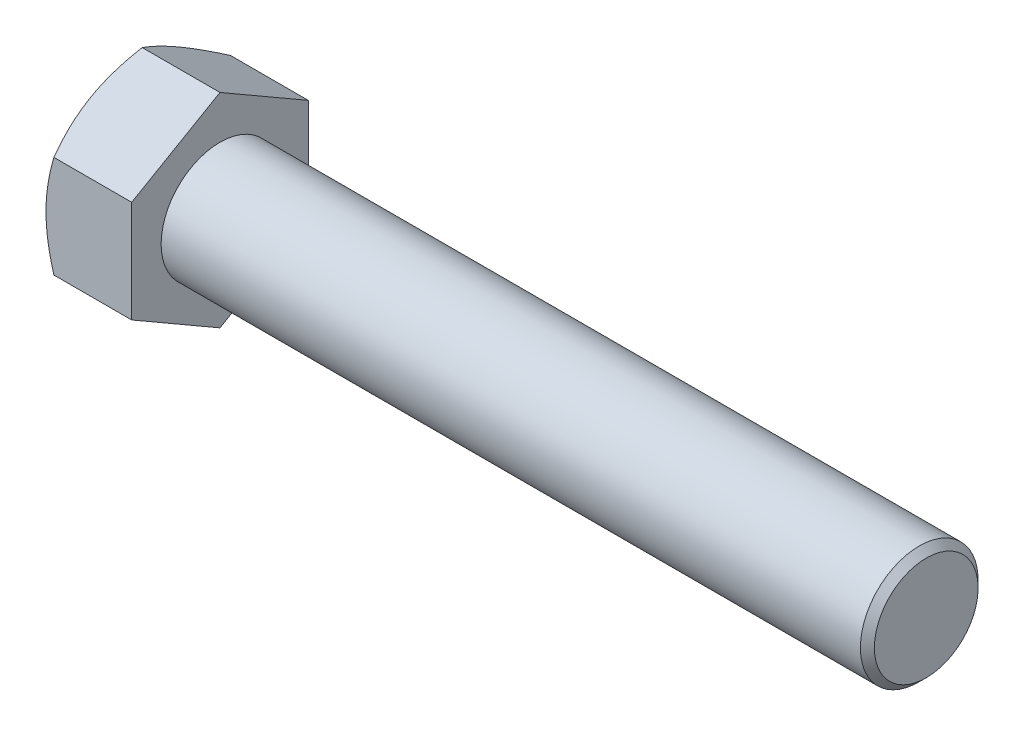
ISO-10303-21;
HEADER;
FILE_DESCRIPTION(('STEP AP214'),'2;1');
FILE_NAME('part.step','',(''),(''),'','','');
FILE_SCHEMA(('AUTOMOTIVE_DESIGN { 1 0 10303 214 1 1 1 1 }'));
ENDSEC;
DATA;
#1=APPLICATION_CONTEXT('core data for automotive mechanical design processes');
#2=APPLICATION_PROTOCOL_DEFINITION('international standard','automotive_design',2000,#1);
#3=PRODUCT_CONTEXT('',#1,'mechanical');
#4=PRODUCT('Part','Part','',(#3));
#5=PRODUCT_RELATED_PRODUCT_CATEGORY('part','',(#4));
#6=PRODUCT_DEFINITION_FORMATION('','',#4);
#7=PRODUCT_DEFINITION_CONTEXT('part definition',#1,'design');
#8=PRODUCT_DEFINITION('design','',#6,#7);
#9=PRODUCT_DEFINITION_SHAPE('','',#8);
#10=(LENGTH_UNIT() NAMED_UNIT(*) SI_UNIT(.MILLI.,.METRE.));
#11=(NAMED_UNIT(*) PLANE_ANGLE_UNIT() SI_UNIT($,.RADIAN.));
#12=(NAMED_UNIT(*) SI_UNIT($,.STERADIAN.) SOLID_ANGLE_UNIT());
#13=UNCERTAINTY_MEASURE_WITH_UNIT(LENGTH_MEASURE(1.E-05),#10,'distance_accuracy_value','');
#14=(GEOMETRIC_REPRESENTATION_CONTEXT(3) GLOBAL_UNCERTAINTY_ASSIGNED_CONTEXT((#13)) GLOBAL_UNIT_ASSIGNED_CONTEXT((#10,
#11,#12)) REPRESENTATION_CONTEXT('',''));
#15=CARTESIAN_POINT('',(0.,0.,0.));
#16=DIRECTION('',(0.,0.,1.));
#17=DIRECTION('',(1.,0.,0.));
#18=AXIS2_PLACEMENT_3D('',#15,#16,#17);
#19=CARTESIAN_POINT('',(9.2456,5.49926131403118,-9.525));
#20=DIRECTION('',(0.,-0.866025403784438,0.500000000000001));
#21=DIRECTION('',(0.,-0.500000000000001,-0.866025403784438));
#22=AXIS2_PLACEMENT_3D('',#19,#20,#21);
#23=PLANE('',#22);
#24=CARTESIAN_POINT('',(0.85080535368534,10.9986380981162,0.0002));
#25=CARTESIAN_POINT('',(0.781023201247654,10.8777523132173,-0.209180321357815));
#26=CARTESIAN_POINT('',(0.714408233957876,10.7564158029679,-0.419341321922845));
#27=CARTESIAN_POINT('',(0.588391469790026,10.5127697532954,-0.841348659019077));
#28=CARTESIAN_POINT('',(0.528992045309777,10.3904599078574,-1.05319552558364));
#29=CARTESIAN_POINT('',(0.362766604707597,10.0215595864394,-1.69214962520808));
#30=CARTESIAN_POINT('',(0.268218329918826,9.77351282584137,-2.12177921721668));
#31=CARTESIAN_POINT('',(0.157351628845433,9.40232220358295,-2.76470023426138));
#32=CARTESIAN_POINT('',(0.125769866148956,9.28028730086357,-2.97607088606807));
#33=CARTESIAN_POINT('',(0.0728092531292063,9.03565248016184,-3.39979082482397));
#34=CARTESIAN_POINT('',(0.0514305991810341,8.91305255135051,-3.61214013052952));
#35=CARTESIAN_POINT('',(0.0194239766724832,8.66764818787802,-4.03719295646296));
#36=CARTESIAN_POINT('',(0.00878323258550251,8.54484417077186,-4.24989575346439));
#37=CARTESIAN_POINT('',(-0.00152146504907483,8.29912270270346,-4.67549782066928));
#38=CARTESIAN_POINT('',(-0.0011857577353514,8.17620525536319,-4.88839708459929));
#39=CARTESIAN_POINT('',(0.00969884023177861,7.94640807689151,-5.28641747314822));
#40=CARTESIAN_POINT('',(0.0189199445075671,7.83951212670956,-5.4715666899867));
#41=CARTESIAN_POINT('',(0.0454848010115662,7.62597023317658,-5.84143209913029));
#42=CARTESIAN_POINT('',(0.0628291278252554,7.5193243080471,-6.02614825987472));
#43=CARTESIAN_POINT('',(0.126636878025749,7.19979976097279,-6.57958100967286));
#44=CARTESIAN_POINT('',(0.184867121471559,6.98748672019119,-6.94731798341605));
#45=CARTESIAN_POINT('',(0.330443291970775,6.56060850831896,-7.68669273502289));
#46=CARTESIAN_POINT('',(0.41840629634645,6.3460978161353,-8.05823615265175));
#47=CARTESIAN_POINT('',(0.618045797355988,5.92027529884848,-8.79578238759941));
#48=CARTESIAN_POINT('',(0.729675405460148,5.70895802095901,-9.16179464942111));
#49=CARTESIAN_POINT('',(0.850805353685332,5.49914584397734,-9.5252));
#50=B_SPLINE_CURVE_WITH_KNOTS('',3,(#24,#25,#26,#27,#28,#29,#30,#31,#32,#33,#34,#35,#36,#37,#38,
#39,#40,#41,#42,#43,#44,#45,#46,#47,#48,#49),.UNSPECIFIED.,.F.,.F.,(4,2,2,2,2,2,2,2,2,2,2,2,4),
(0.,0.754861746958004,1.50997101692212,3.02340406075151,3.76154608748042,4.49970232035707,
5.23697928598072,5.97423347202913,6.61604550518408,7.25790294292824,8.54252993638602,
9.85564695316764,11.1661863217647),.UNSPECIFIED.);
#51=CARTESIAN_POINT('',(0.850738685968815,10.9985226280624,0.));
#52=VERTEX_POINT('',#51);
#53=CARTESIAN_POINT('',(0.,8.24889197104677,-4.76250000000001));
#54=VERTEX_POINT('',#53);
#55=EDGE_CURVE('E51',#52,#54,#50,.T.);
#56=ORIENTED_EDGE('',*,*,#55,.F.);
#57=DIRECTION('',(-1.,0.,0.));
#58=VECTOR('',#57,1.);
#59=CARTESIAN_POINT('',(9.2456,10.9985226280624,0.));
#60=LINE('',#59,#58);
#61=CARTESIAN_POINT('',(9.2456,10.9985226280624,0.));
#62=VERTEX_POINT('',#61);
#63=EDGE_CURVE('E147',#62,#52,#60,.T.);
#64=ORIENTED_EDGE('',*,*,#63,.F.);
#65=DIRECTION('',(0.,0.500000000000001,0.866025403784438));
#66=VECTOR('',#65,1.);
#67=CARTESIAN_POINT('',(9.2456,5.49926131403118,-9.525));
#68=LINE('',#67,#66);
#69=CARTESIAN_POINT('',(9.2456,5.49926131403118,-9.525));
#70=VERTEX_POINT('',#69);
#71=EDGE_CURVE('E232',#70,#62,#68,.T.);
#72=ORIENTED_EDGE('',*,*,#71,.F.);
#73=DIRECTION('',(-1.,0.,0.));
#74=VECTOR('',#73,1.);
#75=CARTESIAN_POINT('',(9.2456,5.49926131403118,-9.525));
#76=LINE('',#75,#74);
#77=CARTESIAN_POINT('',(0.850738685968809,5.49926131403118,-9.525));
#78=VERTEX_POINT('',#77);
#79=EDGE_CURVE('E135',#70,#78,#76,.T.);
#80=ORIENTED_EDGE('',*,*,#79,.T.);
#81=EDGE_CURVE('E129',#54,#78,#50,.T.);
#82=ORIENTED_EDGE('',*,*,#81,.F.);
#83=EDGE_LOOP('',(#56,#64,#72,#80,#82));
#84=FACE_BOUND('',#83,.T.);
#85=ADVANCED_FACE('F35',(#84),#23,.F.);
#86=CARTESIAN_POINT('',(9.2456,10.9985226280624,0.));
#87=DIRECTION('',(0.,-0.866025403784438,-0.500000000000001));
#88=DIRECTION('',(0.,0.500000000000001,-0.866025403784438));
#89=AXIS2_PLACEMENT_3D('',#86,#87,#88);
#90=PLANE('',#89);
#91=CARTESIAN_POINT('',(0.850805353685333,5.49914584397734,9.5252));
#92=CARTESIAN_POINT('',(0.781023201247648,5.62003162887629,9.31581967864219));
#93=CARTESIAN_POINT('',(0.71440823395787,5.74136813912567,9.10565867807716));
#94=CARTESIAN_POINT('',(0.588391469790021,5.98501418879817,8.68365134098092));
#95=CARTESIAN_POINT('',(0.528992045309771,6.1073240342362,8.47180447441637));
#96=CARTESIAN_POINT('',(0.362766604707592,6.47622435565419,7.83285037479193));
#97=CARTESIAN_POINT('',(0.268218329918823,6.72427111625219,7.40322078278332));
#98=CARTESIAN_POINT('',(0.157351628845431,7.09546173851061,6.76029976573862));
#99=CARTESIAN_POINT('',(0.125769866148954,7.21749664122999,6.54892911393193));
#100=CARTESIAN_POINT('',(0.0728092531292047,7.46213146193172,6.12520917517604));
#101=CARTESIAN_POINT('',(0.0514305991810333,7.58473139074305,5.91285986947049));
#102=CARTESIAN_POINT('',(0.0194239766724829,7.83013575421554,5.48780704353704));
#103=CARTESIAN_POINT('',(0.00878323258550203,7.9529397713217,5.27510424653562));
#104=CARTESIAN_POINT('',(-0.00152146504907482,8.1986612393901,4.84950217933072));
#105=CARTESIAN_POINT('',(-0.00118575773535079,8.32157868673037,4.63660291540071));
#106=CARTESIAN_POINT('',(0.00969884023177998,8.55137586520205,4.23858252685179));
#107=CARTESIAN_POINT('',(0.0189199445075688,8.658271815384,4.05343331001331));
#108=CARTESIAN_POINT('',(0.0454848010115681,8.87181370891698,3.68356790086971));
#109=CARTESIAN_POINT('',(0.0628291278252573,8.97845963404645,3.49885174012528));
#110=CARTESIAN_POINT('',(0.126636878025752,9.29798418112077,2.94541899032714));
#111=CARTESIAN_POINT('',(0.184867121471562,9.51029722190237,2.57768201658395));
#112=CARTESIAN_POINT('',(0.330443291970781,9.9371754337746,1.83830726497711));
#113=CARTESIAN_POINT('',(0.418406296346457,10.1516861259583,1.46676384734825));
#114=CARTESIAN_POINT('',(0.618045797355995,10.5775086432451,0.729217612400586));
#115=CARTESIAN_POINT('',(0.729675405460156,10.7888259211345,0.363205350578886));
#116=CARTESIAN_POINT('',(0.85080535368534,10.9986380981162,-0.000199999999999453));
#117=B_SPLINE_CURVE_WITH_KNOTS('',3,(#91,#92,#93,#94,#95,#96,#97,#98,#99,#100,#101,#102,#103,
#104,#105,#106,#107,#108,#109,#110,#111,#112,#113,#114,#115,#116),.UNSPECIFIED.,.F.,.F.,(4,2,2,
2,2,2,2,2,2,2,2,2,4),(0.,0.754861746958003,1.50997101692211,3.02340406075151,3.76154608748042,
4.49970232035706,5.23697928598072,5.97423347202913,6.61604550518408,7.25790294292824,
8.54252993638602,9.85564695316764,11.1661863217647),.UNSPECIFIED.);
#118=CARTESIAN_POINT('',(0.850738685968809,5.49926131403118,9.525));
#119=VERTEX_POINT('',#118);
#120=CARTESIAN_POINT('',(0.,8.24889197104677,4.76250000000001));
#121=VERTEX_POINT('',#120);
#122=EDGE_CURVE('E58',#119,#121,#117,.T.);
#123=ORIENTED_EDGE('',*,*,#122,.F.);
#124=DIRECTION('',(-1.,0.,0.));
#125=VECTOR('',#124,1.);
#126=CARTESIAN_POINT('',(9.2456,5.49926131403118,9.525));
#127=LINE('',#126,#125);
#128=CARTESIAN_POINT('',(9.2456,5.49926131403118,9.525));
#129=VERTEX_POINT('',#128);
#130=EDGE_CURVE('E145',#129,#119,#127,.T.);
#131=ORIENTED_EDGE('',*,*,#130,.F.);
#132=DIRECTION('',(0.,-0.500000000000001,0.866025403784438));
#133=VECTOR('',#132,1.);
#134=CARTESIAN_POINT('',(9.2456,10.9985226280624,0.));
#135=LINE('',#134,#133);
#136=EDGE_CURVE('E230',#62,#129,#135,.T.);
#137=ORIENTED_EDGE('',*,*,#136,.F.);
#138=ORIENTED_EDGE('',*,*,#63,.T.);
#139=EDGE_CURVE('E162',#121,#52,#117,.T.);
#140=ORIENTED_EDGE('',*,*,#139,.F.);
#141=EDGE_LOOP('',(#123,#131,#137,#138,#140));
#142=FACE_BOUND('',#141,.T.);
#143=ADVANCED_FACE('F168',(#142),#90,.F.);
#144=CARTESIAN_POINT('',(9.2456,5.49926131403118,9.525));
#145=DIRECTION('',(0.,0.,-1.));
#146=DIRECTION('',(-1.,0.,0.));
#147=AXIS2_PLACEMENT_3D('',#144,#145,#146);
#148=PLANE('',#147);
#149=CARTESIAN_POINT('',(4.652978620201,-14.7810115366526,9.525));
#150=CARTESIAN_POINT('',(4.55200114697973,-14.5729402848548,9.525));
#151=CARTESIAN_POINT('',(4.45152657852499,-14.3646250845143,9.525));
#152=CARTESIAN_POINT('',(4.25169715270383,-13.9474558848886,9.525));
#153=CARTESIAN_POINT('',(4.15234230655457,-13.7386018802315,9.525));
#154=CARTESIAN_POINT('',(3.85610205085235,-13.1110997604408,9.525));
#155=CARTESIAN_POINT('',(3.66107082946321,-12.6915729928092,9.525));
#156=CARTESIAN_POINT('',(3.27608312845874,-11.8474364819289,9.525));
#157=CARTESIAN_POINT('',(3.0861599652033,-11.4228115070931,9.525));
#158=CARTESIAN_POINT('',(2.71407238167632,-10.5701875182868,9.525));
#159=CARTESIAN_POINT('',(2.53190759510787,-10.1421886647409,9.525));
#160=CARTESIAN_POINT('',(2.17173180421228,-9.26840827793762,9.525));
#161=CARTESIAN_POINT('',(1.99403865760542,-8.82249500065039,9.525));
#162=CARTESIAN_POINT('',(1.65207801715252,-7.92545654404829,9.525));
#163=CARTESIAN_POINT('',(1.48781202814776,-7.47433078699668,9.525));
#164=CARTESIAN_POINT('',(1.17701101312695,-6.56698486643262,9.525));
#165=CARTESIAN_POINT('',(1.03044020737989,-6.11077709183234,9.525));
#166=CARTESIAN_POINT('',(0.759723980462397,-5.19183461770946,9.525));
#167=CARTESIAN_POINT('',(0.635571508908768,-4.72910201971935,9.525));
#168=CARTESIAN_POINT('',(0.416296039044828,-3.79927533749825,9.525));
#169=CARTESIAN_POINT('',(0.321019170056998,-3.33221854628569,9.525));
#170=CARTESIAN_POINT('',(0.203895327456021,-2.62737339603034,9.525));
#171=CARTESIAN_POINT('',(0.169151073901595,-2.39169815065083,9.525));
#172=CARTESIAN_POINT('',(0.10894089832577,-1.91917305353182,9.525));
#173=CARTESIAN_POINT('',(0.0834740799106724,-1.68232331751526,9.525));
#174=CARTESIAN_POINT('',(0.0426462139382919,-1.21086692666172,9.525));
#175=CARTESIAN_POINT('',(0.0271575476697097,-0.976271367216093,9.525));
#176=CARTESIAN_POINT('',(0.00611497588533555,-0.506635508477946,9.525));
#177=CARTESIAN_POINT('',(0.000560905150696466,-0.271595216646692,9.525));
#178=CARTESIAN_POINT('',(-0.00047996713179039,0.198511625361335,9.525));
#179=CARTESIAN_POINT('',(0.00403333600034654,0.433578175785729,9.525));
#180=CARTESIAN_POINT('',(0.0230169602197968,0.903311845567771,9.525));
#181=CARTESIAN_POINT('',(0.0374877771856492,1.13797894444949,9.525));
#182=CARTESIAN_POINT('',(0.083892600232871,1.70156520102241,9.525));
#183=CARTESIAN_POINT('',(0.12052919649143,2.03010533257162,9.525));
#184=CARTESIAN_POINT('',(0.211324091565228,2.68473880457707,9.525));
#185=CARTESIAN_POINT('',(0.265484757377357,3.01083180840529,9.525));
#186=CARTESIAN_POINT('',(0.451380100896851,3.98506326209962,9.525));
#187=CARTESIAN_POINT('',(0.606495020219101,4.62879899939554,9.525));
#188=CARTESIAN_POINT('',(0.875429330956874,5.59158230732314,9.525));
#189=CARTESIAN_POINT('',(0.972405254059028,5.9156214246882,9.525));
#190=CARTESIAN_POINT('',(1.1764087393435,6.56055109397584,9.525));
#191=CARTESIAN_POINT('',(1.28343637307408,6.88144162346875,9.525));
#192=CARTESIAN_POINT('',(1.50582732440541,7.52017825999875,9.525));
#193=CARTESIAN_POINT('',(1.62118794476214,7.83802531476308,9.525));
#194=CARTESIAN_POINT('',(1.85888923263679,8.4710843172018,9.525));
#195=CARTESIAN_POINT('',(1.98122977973553,8.78629631022934,9.525));
#196=CARTESIAN_POINT('',(2.30063477459309,9.58716274310341,9.525));
#197=CARTESIAN_POINT('',(2.50178184900059,10.0711868007297,9.525));
#198=CARTESIAN_POINT('',(2.91473175900992,11.0346830906918,9.525));
#199=CARTESIAN_POINT('',(3.12653548923491,11.514154936841,9.525));
#200=CARTESIAN_POINT('',(3.55844219486127,12.4695072075479,9.525));
#201=CARTESIAN_POINT('',(3.77854763045353,12.9453865165195,9.525));
#202=CARTESIAN_POINT('',(4.22520690131798,13.8940827737157,9.525));
#203=CARTESIAN_POINT('',(4.45176054207862,14.3668998137873,9.525));
#204=CARTESIAN_POINT('',(4.91030379081787,15.31066754278,9.525));
#205=CARTESIAN_POINT('',(5.14230026383005,15.7816148898186,9.525));
#206=CARTESIAN_POINT('',(5.6104341919885,16.7214473380242,9.525));
#207=CARTESIAN_POINT('',(5.84657167244607,17.190332426564,9.525));
#208=CARTESIAN_POINT('',(6.32217781208353,18.1263065899709,9.525));
#209=CARTESIAN_POINT('',(6.56164589066583,18.5933959601918,9.525));
#210=CARTESIAN_POINT('',(7.0433639405291,19.5261387749102,9.525));
#211=CARTESIAN_POINT('',(7.28561392258588,19.9917922138368,9.525));
#212=CARTESIAN_POINT('',(7.96929589667506,21.2980525732429,9.525));
#213=CARTESIAN_POINT('',(8.41334550528854,22.137289288128,9.525));
#214=CARTESIAN_POINT('',(9.30698696570736,23.81285124024,9.525));
#215=CARTESIAN_POINT('',(9.7565790806491,24.6491763367986,9.525));
#216=CARTESIAN_POINT('',(10.6586387715906,26.3171534675354,9.525));
#217=CARTESIAN_POINT('',(11.1110942984919,27.1488120222569,9.525));
#218=CARTESIAN_POINT('',(11.7921739160347,28.394953533384,9.525));
#219=CARTESIAN_POINT('',(12.0195924712891,28.8100962856009,9.525));
#220=CARTESIAN_POINT('',(12.4751463020887,29.6399876727052,9.525));
#221=CARTESIAN_POINT('',(12.7032815766791,30.0547363081167,9.525));
#222=CARTESIAN_POINT('',(12.9317320980145,30.4693112732241,9.525));
#223=B_SPLINE_CURVE_WITH_KNOTS('',3,(#149,#150,#151,#152,#153,#154,#155,#156,#157,#158,#159,
#160,#161,#162,#163,#164,#165,#166,#167,#168,#169,#170,#171,#172,#173,#174,#175,#176,#177,#178,
#179,#180,#181,#182,#183,#184,#185,#186,#187,#188,#189,#190,#191,#192,#193,#194,#195,#196,#197,
#198,#199,#200,#201,#202,#203,#204,#205,#206,#207,#208,#209,#210,#211,#212,#213,#214,#215,#216,
#217,#218,#219,#220,#221,#222),.UNSPECIFIED.,.F.,.F.,(4,2,2,2,2,2,2,2,2,2,2,2,2,2,2,2,2,2,2,2,2,
2,2,2,2,2,2,2,2,2,2,2,2,2,2,2,4),(0.,0.693836530044209,1.38768000463458,2.77557197297935,
4.17100213114403,5.56636633354269,7.00624082823088,8.44627647542749,9.88334978435086,
11.3199703553045,12.748795200913,13.4633089947651,14.177753733363,14.882869257303,
15.5879730545998,16.2930841835603,16.9982304291964,17.9894005549206,18.9807046150987,
20.9643780182785,21.979010564481,22.9936503334043,24.0079631400216,25.0222584527869,
26.5945433127102,28.1669603864419,29.7398471611297,31.3126865395143,32.8876294963396,
34.4625820831342,36.0372634785707,37.6119509756548,40.4603369594249,43.3088586981742,
46.1491565485714,47.569213896597,48.9892693539119),.UNSPECIFIED.);
#224=CARTESIAN_POINT('',(0.850738685968816,-5.4992613140312,9.525));
#225=VERTEX_POINT('',#224);
#226=CARTESIAN_POINT('',(0.,0.,9.525));
#227=VERTEX_POINT('',#226);
#228=EDGE_CURVE('E242',#225,#227,#223,.T.);
#229=ORIENTED_EDGE('',*,*,#228,.F.);
#230=DIRECTION('',(-1.,0.,0.));
#231=VECTOR('',#230,1.);
#232=CARTESIAN_POINT('',(9.2456,-5.4992613140312,9.525));
#233=LINE('',#232,#231);
#234=CARTESIAN_POINT('',(9.2456,-5.4992613140312,9.525));
#235=VERTEX_POINT('',#234);
#236=EDGE_CURVE('E137',#235,#225,#233,.T.);
#237=ORIENTED_EDGE('',*,*,#236,.F.);
#238=DIRECTION('',(0.,-1.,0.));
#239=VECTOR('',#238,1.);
#240=CARTESIAN_POINT('',(9.2456,5.49926131403118,9.525));
#241=LINE('',#240,#239);
#242=EDGE_CURVE('E226',#129,#235,#241,.T.);
#243=ORIENTED_EDGE('',*,*,#242,.F.);
#244=ORIENTED_EDGE('',*,*,#130,.T.);
#245=EDGE_CURVE('E184',#227,#119,#223,.T.);
#246=ORIENTED_EDGE('',*,*,#245,.F.);
#247=EDGE_LOOP('',(#229,#237,#243,#244,#246));
#248=FACE_BOUND('',#247,.T.);
#249=ADVANCED_FACE('F248',(#248),#148,.F.);
#250=CARTESIAN_POINT('',(9.2456,-10.9985226280624,0.));
#251=DIRECTION('',(0.,0.866025403784438,-0.500000000000001));
#252=DIRECTION('',(0.,0.500000000000001,0.866025403784438));
#253=AXIS2_PLACEMENT_3D('',#250,#251,#252);
#254=PLANE('',#253);
#255=CARTESIAN_POINT('',(0.850805353685354,-10.9986380981162,-0.000200000000000082));
#256=CARTESIAN_POINT('',(0.781023201247669,-10.8777523132173,0.209180321357815));
#257=CARTESIAN_POINT('',(0.714408233957891,-10.7564158029679,0.419341321922846));
#258=CARTESIAN_POINT('',(0.588391469790041,-10.5127697532954,0.841348659019077));
#259=CARTESIAN_POINT('',(0.528992045309791,-10.3904599078574,1.05319552558364));
#260=CARTESIAN_POINT('',(0.36276660470761,-10.0215595864394,1.69214962520808));
#261=CARTESIAN_POINT('',(0.268218329918839,-9.77351282584139,2.12177921721668));
#262=CARTESIAN_POINT('',(0.157351628845446,-9.40232220358296,2.76470023426139));
#263=CARTESIAN_POINT('',(0.125769866148969,-9.28028730086359,2.97607088606808));
#264=CARTESIAN_POINT('',(0.0728092531292185,-9.03565248016186,3.39979082482398));
#265=CARTESIAN_POINT('',(0.0514305991810461,-8.91305255135053,3.61214013052953));
#266=CARTESIAN_POINT('',(0.0194239766724955,-8.66764818787804,4.03719295646297));
#267=CARTESIAN_POINT('',(0.00878323258551531,-8.54484417077188,4.2498957534644));
#268=CARTESIAN_POINT('',(-0.00152146504906208,-8.29912270270347,4.67549782066929));
#269=CARTESIAN_POINT('',(-0.00118575773533926,-8.17620525536321,4.8883970845993));
#270=CARTESIAN_POINT('',(0.0096988402317905,-7.94640807689153,5.28641747314823));
#271=CARTESIAN_POINT('',(0.0189199445075792,-7.83951212670958,5.47156668998671));
#272=CARTESIAN_POINT('',(0.0454848010115784,-7.6259702331766,5.8414320991303));
#273=CARTESIAN_POINT('',(0.0628291278252675,-7.51932430804712,6.02614825987473));
#274=CARTESIAN_POINT('',(0.126636878025761,-7.19979976097281,6.57958100967287));
#275=CARTESIAN_POINT('',(0.18486712147157,-6.98748672019121,6.94731798341605));
#276=CARTESIAN_POINT('',(0.330443291970786,-6.56060850831898,7.68669273502289));
#277=CARTESIAN_POINT('',(0.418406296346461,-6.34609781613532,8.05823615265176));
#278=CARTESIAN_POINT('',(0.618045797355997,-5.9202752988485,8.79578238759942));
#279=CARTESIAN_POINT('',(0.729675405460156,-5.70895802095904,9.16179464942112));
#280=CARTESIAN_POINT('',(0.85080535368534,-5.49914584397737,9.5252));
#281=B_SPLINE_CURVE_WITH_KNOTS('',3,(#255,#256,#257,#258,#259,#260,#261,#262,#263,#264,#265,
#266,#267,#268,#269,#270,#271,#272,#273,#274,#275,#276,#277,#278,#279,#280),.UNSPECIFIED.,.F.,
.F.,(4,2,2,2,2,2,2,2,2,2,2,2,4),(0.,0.754861746958004,1.50997101692212,3.02340406075152,
3.76154608748043,4.49970232035708,5.23697928598073,5.97423347202914,6.61604550518409,
7.25790294292825,8.54252993638602,9.85564695316764,11.1661863217647),.UNSPECIFIED.);
#282=CARTESIAN_POINT('',(0.850738685968829,-10.9985226280624,0.));
#283=VERTEX_POINT('',#282);
#284=CARTESIAN_POINT('',(0.,-8.24889197104677,4.76250000000001));
#285=VERTEX_POINT('',#284);
#286=EDGE_CURVE('E170',#283,#285,#281,.T.);
#287=ORIENTED_EDGE('',*,*,#286,.F.);
#288=DIRECTION('',(-1.,0.,0.));
#289=VECTOR('',#288,1.);
#290=CARTESIAN_POINT('',(9.2456,-10.9985226280624,0.));
#291=LINE('',#290,#289);
#292=CARTESIAN_POINT('',(9.2456,-10.9985226280624,0.));
#293=VERTEX_POINT('',#292);
#294=EDGE_CURVE('E134',#293,#283,#291,.T.);
#295=ORIENTED_EDGE('',*,*,#294,.F.);
#296=DIRECTION('',(0.,-0.500000000000001,-0.866025403784438));
#297=VECTOR('',#296,1.);
#298=CARTESIAN_POINT('',(9.2456,-10.9985226280624,0.));
#299=LINE('',#298,#297);
#300=EDGE_CURVE('E224',#235,#293,#299,.T.);
#301=ORIENTED_EDGE('',*,*,#300,.F.);
#302=ORIENTED_EDGE('',*,*,#236,.T.);
#303=EDGE_CURVE('E172',#285,#225,#281,.T.);
#304=ORIENTED_EDGE('',*,*,#303,.F.);
#305=EDGE_LOOP('',(#287,#295,#301,#302,#304));
#306=FACE_BOUND('',#305,.T.);
#307=ADVANCED_FACE('F220',(#306),#254,.F.);
#308=CARTESIAN_POINT('',(9.2456,-5.4992613140312,-9.525));
#309=DIRECTION('',(0.,0.866025403784438,0.500000000000001));
#310=DIRECTION('',(0.,-0.500000000000001,0.866025403784438));
#311=AXIS2_PLACEMENT_3D('',#308,#309,#310);
#312=PLANE('',#311);
#313=CARTESIAN_POINT('',(0.850805353685339,-5.49914584397736,-9.5252));
#314=CARTESIAN_POINT('',(0.781023201247654,-5.62003162887631,-9.31581967864219));
#315=CARTESIAN_POINT('',(0.714408233957876,-5.74136813912569,-9.10565867807716));
#316=CARTESIAN_POINT('',(0.588391469790027,-5.9850141887982,-8.68365134098092));
#317=CARTESIAN_POINT('',(0.528992045309778,-6.10732403423622,-8.47180447441636));
#318=CARTESIAN_POINT('',(0.3627666047076,-6.47622435565421,-7.83285037479192));
#319=CARTESIAN_POINT('',(0.268218329918831,-6.72427111625221,-7.40322078278332));
#320=CARTESIAN_POINT('',(0.157351628845439,-7.09546173851064,-6.76029976573862));
#321=CARTESIAN_POINT('',(0.125769866148963,-7.21749664123002,-6.54892911393193));
#322=CARTESIAN_POINT('',(0.0728092531292137,-7.46213146193174,-6.12520917517603));
#323=CARTESIAN_POINT('',(0.0514305991810417,-7.58473139074307,-5.91285986947048));
#324=CARTESIAN_POINT('',(0.0194239766724926,-7.83013575421556,-5.48780704353704));
#325=CARTESIAN_POINT('',(0.00878323258551371,-7.95293977132172,-5.27510424653561));
#326=CARTESIAN_POINT('',(-0.00152146504906198,-8.19866123939013,-4.84950217933072));
#327=CARTESIAN_POINT('',(-0.00118575773533868,-8.32157868673039,-4.63660291540071));
#328=CARTESIAN_POINT('',(0.00969884023179145,-8.55137586520208,-4.23858252685178));
#329=CARTESIAN_POINT('',(0.0189199445075802,-8.65827181538402,-4.0534333100133));
#330=CARTESIAN_POINT('',(0.0454848010115799,-8.87181370891701,-3.68356790086971));
#331=CARTESIAN_POINT('',(0.0628291278252695,-8.97845963404648,-3.49885174012528));
#332=CARTESIAN_POINT('',(0.126636878025765,-9.29798418112079,-2.94541899032714));
#333=CARTESIAN_POINT('',(0.184867121471576,-9.5102972219024,-2.57768201658395));
#334=CARTESIAN_POINT('',(0.330443291970794,-9.93717543377462,-1.83830726497711));
#335=CARTESIAN_POINT('',(0.41840629634647,-10.1516861259583,-1.46676384734825));
#336=CARTESIAN_POINT('',(0.618045797356007,-10.5775086432451,-0.729217612400586));
#337=CARTESIAN_POINT('',(0.729675405460168,-10.7888259211346,-0.363205350578887));
#338=CARTESIAN_POINT('',(0.850805353685353,-10.9986380981162,0.000199999999999344));
#339=B_SPLINE_CURVE_WITH_KNOTS('',3,(#313,#314,#315,#316,#317,#318,#319,#320,#321,#322,#323,
#324,#325,#326,#327,#328,#329,#330,#331,#332,#333,#334,#335,#336,#337,#338),.UNSPECIFIED.,.F.,
.F.,(4,2,2,2,2,2,2,2,2,2,2,2,4),(0.,0.754861746958003,1.50997101692212,3.02340406075151,
3.76154608748043,4.49970232035707,5.23697928598072,5.97423347202913,6.61604550518408,
7.25790294292824,8.54252993638602,9.85564695316764,11.1661863217647),.UNSPECIFIED.);
#340=CARTESIAN_POINT('',(0.850738685968814,-5.4992613140312,-9.525));
#341=VERTEX_POINT('',#340);
#342=CARTESIAN_POINT('',(0.,-8.24889197104677,-4.76250000000001));
#343=VERTEX_POINT('',#342);
#344=EDGE_CURVE('E111',#341,#343,#339,.T.);
#345=ORIENTED_EDGE('',*,*,#344,.F.);
#346=DIRECTION('',(-1.,0.,0.));
#347=VECTOR('',#346,1.);
#348=CARTESIAN_POINT('',(9.2456,-5.4992613140312,-9.525));
#349=LINE('',#348,#347);
#350=CARTESIAN_POINT('',(9.2456,-5.4992613140312,-9.525));
#351=VERTEX_POINT('',#350);
#352=EDGE_CURVE('E125',#351,#341,#349,.T.);
#353=ORIENTED_EDGE('',*,*,#352,.F.);
#354=DIRECTION('',(0.,0.500000000000001,-0.866025403784438));
#355=VECTOR('',#354,1.);
#356=CARTESIAN_POINT('',(9.2456,-5.4992613140312,-9.525));
#357=LINE('',#356,#355);
#358=EDGE_CURVE('E222',#293,#351,#357,.T.);
#359=ORIENTED_EDGE('',*,*,#358,.F.);
#360=ORIENTED_EDGE('',*,*,#294,.T.);
#361=EDGE_CURVE('E128',#343,#283,#339,.T.);
#362=ORIENTED_EDGE('',*,*,#361,.F.);
#363=EDGE_LOOP('',(#345,#353,#359,#360,#362));
#364=FACE_BOUND('',#363,.T.);
#365=ADVANCED_FACE('F123',(#364),#312,.F.);
#366=CARTESIAN_POINT('',(9.2456,5.49926131403118,-9.525));
#367=DIRECTION('',(0.,0.,1.));
#368=DIRECTION('',(0.,-1.,0.));
#369=AXIS2_PLACEMENT_3D('',#366,#367,#368);
#370=PLANE('',#369);
#371=CARTESIAN_POINT('',(4.65297862037688,-14.781011537015,-9.525));
#372=CARTESIAN_POINT('',(4.55200114715193,-14.5729402852111,-9.525));
#373=CARTESIAN_POINT('',(4.4515265786935,-14.3646250848645,-9.525));
#374=CARTESIAN_POINT('',(4.25169715286499,-13.9474558852266,-9.525));
#375=CARTESIAN_POINT('',(4.15234230671206,-13.7386018805634,-9.525));
#376=CARTESIAN_POINT('',(3.85610205099883,-13.1110997607544,-9.525));
#377=CARTESIAN_POINT('',(3.66107082960236,-12.6915729931106,-9.525));
#378=CARTESIAN_POINT('',(3.27608312858324,-11.8474364822057,-9.525));
#379=CARTESIAN_POINT('',(3.08615996532047,-11.4228115073574,-9.525));
#380=CARTESIAN_POINT('',(2.71407238177896,-10.5701875185262,-9.525));
#381=CARTESIAN_POINT('',(2.5319075952033,-10.1421886649677,-9.525));
#382=CARTESIAN_POINT('',(2.17173180429313,-9.26840827813855,-9.525));
#383=CARTESIAN_POINT('',(1.9940386576789,-8.82249500083789,-9.525));
#384=CARTESIAN_POINT('',(1.65207801721168,-7.92545654420872,-9.525));
#385=CARTESIAN_POINT('',(1.48781202819995,-7.47433078714345,-9.525));
#386=CARTESIAN_POINT('',(1.17701101316588,-6.56698486655185,-9.525));
#387=CARTESIAN_POINT('',(1.03044020741253,-6.11077709193766,-9.525));
#388=CARTESIAN_POINT('',(0.759723980483504,-5.19183461778659,-9.525));
#389=CARTESIAN_POINT('',(0.635571508924628,-4.7291020197822,-9.525));
#390=CARTESIAN_POINT('',(0.416296039050124,-3.79927533752507,-9.525));
#391=CARTESIAN_POINT('',(0.321019170057397,-3.33221854629066,-9.525));
#392=CARTESIAN_POINT('',(0.203895327451553,-2.62737339600217,-9.525));
#393=CARTESIAN_POINT('',(0.169151073895918,-2.39169815061154,-9.525));
#394=CARTESIAN_POINT('',(0.108940898318591,-1.91917305347024,-9.525));
#395=CARTESIAN_POINT('',(0.0834740799032015,-1.68232331744248,-9.525));
#396=CARTESIAN_POINT('',(0.0426462139312214,-1.21086692656677,-9.525));
#397=CARTESIAN_POINT('',(0.0271575476633146,-0.976271367110177,-9.525));
#398=CARTESIAN_POINT('',(0.00611497588125561,-0.506635508350123,-9.525));
#399=CARTESIAN_POINT('',(0.000560905148256181,-0.271595216507929,-9.525));
#400=CARTESIAN_POINT('',(-0.000479967130014155,0.198511625521894,-9.525));
#401=CARTESIAN_POINT('',(0.00403333600469989,0.433578175957143,-9.525));
#402=CARTESIAN_POINT('',(0.0230169602301713,0.903311845760753,-9.525));
#403=CARTESIAN_POINT('',(0.0374877771994678,1.13797894465319,-9.525));
#404=CARTESIAN_POINT('',(0.0838926002551662,1.70156520124285,-9.525));
#405=CARTESIAN_POINT('',(0.12052919651862,2.03010533279804,-9.525));
#406=CARTESIAN_POINT('',(0.211324091602473,2.68473880481518,-9.525));
#407=CARTESIAN_POINT('',(0.265484757419761,3.01083180864913,-9.525));
#408=CARTESIAN_POINT('',(0.451380100954846,3.98506326236031,-9.525));
#409=CARTESIAN_POINT('',(0.606495020287633,4.62879899966704,-9.525));
#410=CARTESIAN_POINT('',(0.875429331040969,5.59158230761082,-9.525));
#411=CARTESIAN_POINT('',(0.972405254148348,5.91562142498137,-9.525));
#412=CARTESIAN_POINT('',(1.17640873944311,6.56055109427996,-9.525));
#413=CARTESIAN_POINT('',(1.28343637317876,6.88144162377832,-9.525));
#414=CARTESIAN_POINT('',(1.50582732452006,7.52017826031916,-9.525));
#415=CARTESIAN_POINT('',(1.62118794488169,7.8380253150889,-9.525));
#416=CARTESIAN_POINT('',(1.85888923276598,8.47108431753844,-9.525));
#417=CARTESIAN_POINT('',(1.98122977986945,8.78629631057138,-9.525));
#418=CARTESIAN_POINT('',(2.30063477473475,9.58716274344887,-9.525));
#419=CARTESIAN_POINT('',(2.50178184914485,10.0711868010732,-9.525));
#420=CARTESIAN_POINT('',(2.91473175915869,11.0346830910319,-9.525));
#421=CARTESIAN_POINT('',(3.12653548938557,11.5141549371794,-9.525));
#422=CARTESIAN_POINT('',(3.55844219501523,12.4695072078833,-9.525));
#423=CARTESIAN_POINT('',(3.77854763060888,12.9453865168534,-9.525));
#424=CARTESIAN_POINT('',(4.22520690147574,13.8940827740469,-9.525));
#425=CARTESIAN_POINT('',(4.45176054223739,14.3668998141172,-9.525));
#426=CARTESIAN_POINT('',(4.91030379097836,15.3106675431073,-9.525));
#427=CARTESIAN_POINT('',(5.14230026399124,15.7816148901446,-9.525));
#428=CARTESIAN_POINT('',(5.61043419215088,16.7214473383478,-9.525));
#429=CARTESIAN_POINT('',(5.84657167260893,17.1903324268864,-9.525));
#430=CARTESIAN_POINT('',(6.32217781224721,18.1263065902911,-9.525));
#431=CARTESIAN_POINT('',(6.56164589082984,18.5933959605109,-9.525));
#432=CARTESIAN_POINT('',(7.04336394069364,19.5261387752273,-9.525));
#433=CARTESIAN_POINT('',(7.28561392275062,19.9917922141529,-9.525));
#434=CARTESIAN_POINT('',(7.96929589684109,21.2980525735578,-9.525));
#435=CARTESIAN_POINT('',(8.41334550545556,22.1372892884429,-9.525));
#436=CARTESIAN_POINT('',(9.30698696587615,23.8128512405548,-9.525));
#437=CARTESIAN_POINT('',(9.75657908081868,24.6491763371134,-9.525));
#438=CARTESIAN_POINT('',(10.6586387717617,26.3171534678506,-9.525));
#439=CARTESIAN_POINT('',(11.1110942986639,27.1488120225725,-9.525));
#440=CARTESIAN_POINT('',(11.7921739162077,28.3949535337001,-9.525));
#441=CARTESIAN_POINT('',(12.0195924714625,28.8100962859172,-9.525));
#442=CARTESIAN_POINT('',(12.4751463022628,29.639987673022,-9.525));
#443=CARTESIAN_POINT('',(12.7032815768536,30.0547363084337,-9.525));
#444=CARTESIAN_POINT('',(12.9317320981892,30.4693112735413,-9.525));
#445=B_SPLINE_CURVE_WITH_KNOTS('',3,(#371,#372,#373,#374,#375,#376,#377,#378,#379,#380,#381,
#382,#383,#384,#385,#386,#387,#388,#389,#390,#391,#392,#393,#394,#395,#396,#397,#398,#399,#400,
#401,#402,#403,#404,#405,#406,#407,#408,#409,#410,#411,#412,#413,#414,#415,#416,#417,#418,#419,
#420,#421,#422,#423,#424,#425,#426,#427,#428,#429,#430,#431,#432,#433,#434,#435,#436,#437,#438,
#439,#440,#441,#442,#443,#444),.UNSPECIFIED.,.F.,.F.,(4,2,2,2,2,2,2,2,2,2,2,2,2,2,2,2,2,2,2,2,2,
2,2,2,2,2,2,2,2,2,2,2,2,2,2,2,4),(0.,0.693836530065473,1.38768000467711,2.77557197306441,
4.17100213127209,5.56636633371374,7.00624082844753,8.44627647568976,9.88334978465858,
11.3199703556576,12.7487952013331,13.4633089952187,14.17775373385,14.8828692578227,
15.5879730551522,16.2930841841453,16.9982304298141,17.9894005555578,18.9807046157553,
20.9643780189742,21.979010565197,22.9936503341406,24.0079631407782,25.0222584535638,
26.5945433134849,28.1669603872144,29.7398471619,31.3126865402824,32.8876294971052,
34.4625820838974,36.0372634793314,37.6119509764132,40.4603369601845,43.3088586989349,
46.1491565493342,47.5692138973609,48.9892693546768),.UNSPECIFIED.);
#446=CARTESIAN_POINT('',(0.,0.,-9.525));
#447=VERTEX_POINT('',#446);
#448=EDGE_CURVE('E117',#78,#447,#445,.F.);
#449=ORIENTED_EDGE('',*,*,#448,.F.);
#450=ORIENTED_EDGE('',*,*,#79,.F.);
#451=DIRECTION('',(0.,1.,0.));
#452=VECTOR('',#451,1.);
#453=CARTESIAN_POINT('',(9.2456,5.49926131403118,-9.525));
#454=LINE('',#453,#452);
#455=EDGE_CURVE('E133',#351,#70,#454,.T.);
#456=ORIENTED_EDGE('',*,*,#455,.F.);
#457=ORIENTED_EDGE('',*,*,#352,.T.);
#458=EDGE_CURVE('E108',#447,#341,#445,.F.);
#459=ORIENTED_EDGE('',*,*,#458,.F.);
#460=EDGE_LOOP('',(#449,#450,#456,#457,#459));
#461=FACE_BOUND('',#460,.T.);
#462=ADVANCED_FACE('F131',(#461),#370,.F.);
#463=CARTESIAN_POINT('',(9.2456,0.,-19.05));
#464=DIRECTION('',(1.,0.,0.));
#465=DIRECTION('',(0.,0.,-1.));
#466=AXIS2_PLACEMENT_3D('',#463,#464,#465);
#467=PLANE('',#466);
#468=ORIENTED_EDGE('',*,*,#71,.T.);
#469=ORIENTED_EDGE('',*,*,#136,.T.);
#470=ORIENTED_EDGE('',*,*,#242,.T.);
#471=ORIENTED_EDGE('',*,*,#300,.T.);
#472=ORIENTED_EDGE('',*,*,#358,.T.);
#473=ORIENTED_EDGE('',*,*,#455,.T.);
#474=EDGE_LOOP('',(#468,#469,#470,#471,#472,#473));
#475=FACE_BOUND('',#474,.T.);
#476=CARTESIAN_POINT('',(9.2456,0.,0.));
#477=DIRECTION('',(1.,0.,0.));
#478=DIRECTION('',(0.,0.,-1.));
#479=AXIS2_PLACEMENT_3D('',#476,#477,#478);
#480=CIRCLE('',#479,6.35);
#481=CARTESIAN_POINT('',(9.2456,0.,-6.35));
#482=VERTEX_POINT('',#481);
#483=EDGE_CURVE('E235',#482,#482,#480,.F.);
#484=ORIENTED_EDGE('',*,*,#483,.T.);
#485=EDGE_LOOP('',(#484));
#486=FACE_BOUND('',#485,.T.);
#487=ADVANCED_FACE('F250',(#475,#486),#467,.T.);
#488=CARTESIAN_POINT('',(0.,0.,0.));
#489=DIRECTION('',(-1.,0.,0.));
#490=DIRECTION('',(0.,0.,1.));
#491=AXIS2_PLACEMENT_3D('',#488,#489,#490);
#492=CYLINDRICAL_SURFACE('',#491,6.35);
#493=ORIENTED_EDGE('',*,*,#483,.F.);
#494=EDGE_LOOP('',(#493));
#495=FACE_BOUND('',#494,.T.);
#496=CARTESIAN_POINT('',(84.68995,0.,0.));
#497=DIRECTION('',(-1.,0.,0.));
#498=DIRECTION('',(0.,0.,1.));
#499=AXIS2_PLACEMENT_3D('',#496,#497,#498);
#500=CIRCLE('',#499,6.35);
#501=CARTESIAN_POINT('',(84.68995,0.,6.35));
#502=VERTEX_POINT('',#501);
#503=EDGE_CURVE('E238',#502,#502,#500,.T.);
#504=ORIENTED_EDGE('',*,*,#503,.T.);
#505=EDGE_LOOP('',(#504));
#506=FACE_BOUND('',#505,.T.);
#507=ADVANCED_FACE('F282',(#495,#506),#492,.T.);
#508=CARTESIAN_POINT('',(85.4456,0.,0.));
#509=DIRECTION('',(-1.,0.,0.));
#510=DIRECTION('',(0.,0.,1.));
#511=AXIS2_PLACEMENT_3D('',#508,#509,#510);
#512=CONICAL_SURFACE('',#511,5.59435,0.785398163397433);
#513=ORIENTED_EDGE('',*,*,#503,.F.);
#514=EDGE_LOOP('',(#513));
#515=FACE_BOUND('',#514,.T.);
#516=CARTESIAN_POINT('',(85.4456,0.,0.));
#517=DIRECTION('',(-1.,0.,0.));
#518=DIRECTION('',(0.,0.,1.));
#519=AXIS2_PLACEMENT_3D('',#516,#517,#518);
#520=CIRCLE('',#519,5.59435);
#521=CARTESIAN_POINT('',(85.4456,0.,5.59435));
#522=VERTEX_POINT('',#521);
#523=EDGE_CURVE('E240',#522,#522,#520,.T.);
#524=ORIENTED_EDGE('',*,*,#523,.T.);
#525=EDGE_LOOP('',(#524));
#526=FACE_BOUND('',#525,.T.);
#527=ADVANCED_FACE('F284',(#515,#526),#512,.T.);
#528=CARTESIAN_POINT('',(85.4456,0.,0.));
#529=DIRECTION('',(-1.,0.,0.));
#530=DIRECTION('',(0.,0.,1.));
#531=AXIS2_PLACEMENT_3D('',#528,#529,#530);
#532=PLANE('',#531);
#533=ORIENTED_EDGE('',*,*,#523,.F.);
#534=EDGE_LOOP('',(#533));
#535=FACE_BOUND('',#534,.T.);
#536=ADVANCED_FACE('F197',(#535),#532,.F.);
#537=CARTESIAN_POINT('',(0.,0.,0.));
#538=DIRECTION('',(1.,0.,0.));
#539=DIRECTION('',(0.,0.,-1.));
#540=AXIS2_PLACEMENT_3D('',#537,#538,#539);
#541=CONICAL_SURFACE('',#540,9.525,1.0471975511966);
#542=ORIENTED_EDGE('',*,*,#344,.T.);
#543=CARTESIAN_POINT('',(0.,0.,0.));
#544=DIRECTION('',(1.,0.,0.));
#545=DIRECTION('',(0.,0.,-1.));
#546=AXIS2_PLACEMENT_3D('',#543,#544,#545);
#547=CIRCLE('',#546,9.525);
#548=EDGE_CURVE('E39',#343,#447,#547,.T.);
#549=ORIENTED_EDGE('',*,*,#548,.T.);
#550=ORIENTED_EDGE('',*,*,#458,.T.);
#551=EDGE_LOOP('',(#542,#549,#550));
#552=FACE_BOUND('',#551,.T.);
#553=ADVANCED_FACE('F110',(#552),#541,.T.);
#554=ORIENTED_EDGE('',*,*,#286,.T.);
#555=EDGE_CURVE('E152',#285,#343,#547,.T.);
#556=ORIENTED_EDGE('',*,*,#555,.T.);
#557=ORIENTED_EDGE('',*,*,#361,.T.);
#558=EDGE_LOOP('',(#554,#556,#557));
#559=FACE_BOUND('',#558,.T.);
#560=ADVANCED_FACE('F196',(#559),#541,.T.);
#561=ORIENTED_EDGE('',*,*,#228,.T.);
#562=EDGE_CURVE('E153',#227,#285,#547,.T.);
#563=ORIENTED_EDGE('',*,*,#562,.T.);
#564=ORIENTED_EDGE('',*,*,#303,.T.);
#565=EDGE_LOOP('',(#561,#563,#564));
#566=FACE_BOUND('',#565,.T.);
#567=ADVANCED_FACE('F191',(#566),#541,.T.);
#568=ORIENTED_EDGE('',*,*,#245,.T.);
#569=ORIENTED_EDGE('',*,*,#122,.T.);
#570=CARTESIAN_POINT('',(0.,0.,0.));
#571=DIRECTION('',(-1.,0.,0.));
#572=DIRECTION('',(0.,0.,1.));
#573=AXIS2_PLACEMENT_3D('',#570,#571,#572);
#574=CIRCLE('',#573,9.525);
#575=EDGE_CURVE('E118',#227,#121,#574,.T.);
#576=ORIENTED_EDGE('',*,*,#575,.F.);
#577=EDGE_LOOP('',(#568,#569,#576));
#578=FACE_BOUND('',#577,.T.);
#579=ADVANCED_FACE('F195',(#578),#541,.T.);
#580=ORIENTED_EDGE('',*,*,#139,.T.);
#581=ORIENTED_EDGE('',*,*,#55,.T.);
#582=EDGE_CURVE('E44',#54,#121,#547,.T.);
#583=ORIENTED_EDGE('',*,*,#582,.T.);
#584=EDGE_LOOP('',(#580,#581,#583));
#585=FACE_BOUND('',#584,.T.);
#586=ADVANCED_FACE('F161',(#585),#541,.T.);
#587=ORIENTED_EDGE('',*,*,#81,.T.);
#588=ORIENTED_EDGE('',*,*,#448,.T.);
#589=EDGE_CURVE('E11',#447,#54,#547,.T.);
#590=ORIENTED_EDGE('',*,*,#589,.T.);
#591=EDGE_LOOP('',(#587,#588,#590));
#592=FACE_BOUND('',#591,.T.);
#593=ADVANCED_FACE('F254',(#592),#541,.T.);
#594=CARTESIAN_POINT('',(0.,0.,-19.05));
#595=DIRECTION('',(1.,0.,0.));
#596=DIRECTION('',(0.,0.,-1.));
#597=AXIS2_PLACEMENT_3D('',#594,#595,#596);
#598=PLANE('',#597);
#599=ORIENTED_EDGE('',*,*,#589,.F.);
#600=ORIENTED_EDGE('',*,*,#548,.F.);
#601=ORIENTED_EDGE('',*,*,#555,.F.);
#602=ORIENTED_EDGE('',*,*,#562,.F.);
#603=ORIENTED_EDGE('',*,*,#575,.T.);
#604=ORIENTED_EDGE('',*,*,#582,.F.);
#605=EDGE_LOOP('',(#599,#600,#601,#602,#603,#604));
#606=FACE_BOUND('',#605,.T.);
#607=ADVANCED_FACE('F165',(#606),#598,.F.);
#608=CLOSED_SHELL('',(#85,#143,#249,#307,#365,#462,#487,#507,#527,#536,#553,#560,#567,#579,#586,
#593,#607));
#609=MANIFOLD_SOLID_BREP('B2',#608);
#610=ADVANCED_BREP_SHAPE_REPRESENTATION('',(#18,#609),#14);
#611=SHAPE_DEFINITION_REPRESENTATION(#9,#610);
ENDSEC;
END-ISO-10303-21;
